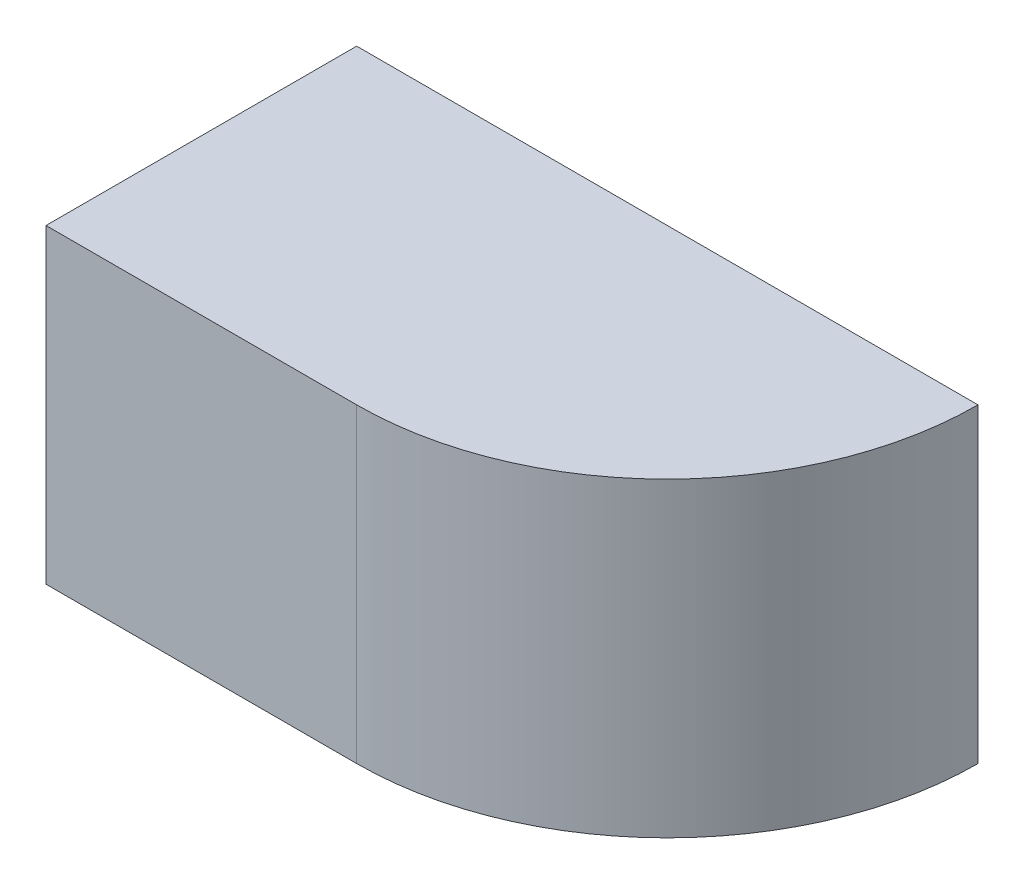
ISO-10303-21;
HEADER;
FILE_DESCRIPTION(('STEP AP214'),'2;1');
FILE_NAME('part.step','',(''),(''),'','','');
FILE_SCHEMA(('AUTOMOTIVE_DESIGN { 1 0 10303 214 1 1 1 1 }'));
ENDSEC;
DATA;
#1=APPLICATION_CONTEXT('core data for automotive mechanical design processes');
#2=APPLICATION_PROTOCOL_DEFINITION('international standard','automotive_design',2000,#1);
#3=PRODUCT_CONTEXT('',#1,'mechanical');
#4=PRODUCT('Part','Part','',(#3));
#5=PRODUCT_RELATED_PRODUCT_CATEGORY('part','',(#4));
#6=PRODUCT_DEFINITION_FORMATION('','',#4);
#7=PRODUCT_DEFINITION_CONTEXT('part definition',#1,'design');
#8=PRODUCT_DEFINITION('design','',#6,#7);
#9=PRODUCT_DEFINITION_SHAPE('','',#8);
#10=(LENGTH_UNIT() NAMED_UNIT(*) SI_UNIT(.MILLI.,.METRE.));
#11=(NAMED_UNIT(*) PLANE_ANGLE_UNIT() SI_UNIT($,.RADIAN.));
#12=(NAMED_UNIT(*) SI_UNIT($,.STERADIAN.) SOLID_ANGLE_UNIT());
#13=UNCERTAINTY_MEASURE_WITH_UNIT(LENGTH_MEASURE(1.E-05),#10,'distance_accuracy_value','');
#14=(GEOMETRIC_REPRESENTATION_CONTEXT(3) GLOBAL_UNCERTAINTY_ASSIGNED_CONTEXT((#13)) GLOBAL_UNIT_ASSIGNED_CONTEXT((#10,
#11,#12)) REPRESENTATION_CONTEXT('',''));
#15=CARTESIAN_POINT('',(0.,0.,0.));
#16=DIRECTION('',(0.,0.,1.));
#17=DIRECTION('',(1.,0.,0.));
#18=AXIS2_PLACEMENT_3D('',#15,#16,#17);
#19=CARTESIAN_POINT('',(2.00000002980232,-4.75000013038516,2.));
#20=DIRECTION('',(0.,0.,1.));
#21=DIRECTION('',(1.,0.,0.));
#22=AXIS2_PLACEMENT_3D('',#19,#20,#21);
#23=PLANE('',#22);
#24=DIRECTION('',(0.,-1.,0.));
#25=VECTOR('',#24,1.);
#26=CARTESIAN_POINT('',(1.50000002235174,-4.50000012665987,2.));
#27=LINE('',#26,#25);
#28=CARTESIAN_POINT('',(1.50000002235174,-4.50000012665987,2.));
#29=VERTEX_POINT('',#28);
#30=CARTESIAN_POINT('',(1.50000002235174,-5.00000013411045,2.));
#31=VERTEX_POINT('',#30);
#32=EDGE_CURVE('E11',#29,#31,#27,.T.);
#33=ORIENTED_EDGE('',*,*,#32,.F.);
#34=DIRECTION('',(-1.,0.,0.));
#35=VECTOR('',#34,1.);
#36=CARTESIAN_POINT('',(2.5000000372529,-4.50000012665987,2.));
#37=LINE('',#36,#35);
#38=CARTESIAN_POINT('',(2.5000000372529,-4.50000012665987,2.));
#39=VERTEX_POINT('',#38);
#40=EDGE_CURVE('E66',#39,#29,#37,.T.);
#41=ORIENTED_EDGE('',*,*,#40,.F.);
#42=DIRECTION('',(0.,1.,0.));
#43=VECTOR('',#42,1.);
#44=CARTESIAN_POINT('',(2.5000000372529,-5.00000013411045,2.));
#45=LINE('',#44,#43);
#46=CARTESIAN_POINT('',(2.5000000372529,-5.00000013411045,2.));
#47=VERTEX_POINT('',#46);
#48=EDGE_CURVE('E84',#47,#39,#45,.T.);
#49=ORIENTED_EDGE('',*,*,#48,.F.);
#50=DIRECTION('',(1.,0.,0.));
#51=VECTOR('',#50,1.);
#52=CARTESIAN_POINT('',(1.50000002235174,-5.00000013411045,2.));
#53=LINE('',#52,#51);
#54=EDGE_CURVE('E28',#31,#47,#53,.T.);
#55=ORIENTED_EDGE('',*,*,#54,.F.);
#56=EDGE_LOOP('',(#33,#41,#49,#55));
#57=FACE_BOUND('',#56,.T.);
#58=ADVANCED_FACE('F17',(#57),#23,.F.);
#59=CARTESIAN_POINT('',(1.50000002235174,-4.50000012665987,2.));
#60=DIRECTION('',(-1.,0.,0.));
#61=DIRECTION('',(0.,0.,1.));
#62=AXIS2_PLACEMENT_3D('',#59,#60,#61);
#63=PLANE('',#62);
#64=ORIENTED_EDGE('',*,*,#32,.T.);
#65=DIRECTION('',(0.,0.,1.));
#66=VECTOR('',#65,1.);
#67=CARTESIAN_POINT('',(1.50000002235174,-5.00000013411045,2.));
#68=LINE('',#67,#66);
#69=CARTESIAN_POINT('',(1.50000002235174,-5.00000013411045,2.5));
#70=VERTEX_POINT('',#69);
#71=EDGE_CURVE('E110',#31,#70,#68,.T.);
#72=ORIENTED_EDGE('',*,*,#71,.T.);
#73=DIRECTION('',(0.,-1.,0.));
#74=VECTOR('',#73,1.);
#75=CARTESIAN_POINT('',(1.50000002235174,-4.50000012665987,2.5));
#76=LINE('',#75,#74);
#77=CARTESIAN_POINT('',(1.50000002235174,-4.50000012665987,2.5));
#78=VERTEX_POINT('',#77);
#79=EDGE_CURVE('E21',#78,#70,#76,.T.);
#80=ORIENTED_EDGE('',*,*,#79,.F.);
#81=DIRECTION('',(0.,0.,1.));
#82=VECTOR('',#81,1.);
#83=CARTESIAN_POINT('',(1.50000002235174,-4.50000012665987,2.));
#84=LINE('',#83,#82);
#85=EDGE_CURVE('E79',#29,#78,#84,.T.);
#86=ORIENTED_EDGE('',*,*,#85,.F.);
#87=EDGE_LOOP('',(#64,#72,#80,#86));
#88=FACE_BOUND('',#87,.T.);
#89=ADVANCED_FACE('F108',(#88),#63,.T.);
#90=CARTESIAN_POINT('',(1.50000002235174,-5.00000013411045,2.));
#91=DIRECTION('',(0.,-1.,0.));
#92=DIRECTION('',(0.,0.,-1.));
#93=AXIS2_PLACEMENT_3D('',#90,#91,#92);
#94=PLANE('',#93);
#95=CARTESIAN_POINT('',(2.0000000372529,-5.00000013411045,2.));
#96=DIRECTION('',(0.,1.,0.));
#97=DIRECTION('',(0.707106781186548,0.,0.707106781186548));
#98=AXIS2_PLACEMENT_3D('',#95,#96,#97);
#99=CIRCLE('',#98,0.5);
#100=CARTESIAN_POINT('',(2.0000000372529,-5.00000013411045,2.5));
#101=VERTEX_POINT('',#100);
#102=EDGE_CURVE('E95',#101,#47,#99,.T.);
#103=ORIENTED_EDGE('',*,*,#102,.F.);
#104=DIRECTION('',(1.,0.,0.));
#105=VECTOR('',#104,1.);
#106=CARTESIAN_POINT('',(1.50000002235174,-5.00000013411045,2.5));
#107=LINE('',#106,#105);
#108=EDGE_CURVE('E90',#70,#101,#107,.T.);
#109=ORIENTED_EDGE('',*,*,#108,.F.);
#110=ORIENTED_EDGE('',*,*,#71,.F.);
#111=ORIENTED_EDGE('',*,*,#54,.T.);
#112=EDGE_LOOP('',(#103,#109,#110,#111));
#113=FACE_BOUND('',#112,.T.);
#114=ADVANCED_FACE('F114',(#113),#94,.T.);
#115=CARTESIAN_POINT('',(2.5000000372529,-4.50000012665987,2.));
#116=DIRECTION('',(0.,1.,0.));
#117=DIRECTION('',(1.,0.,0.));
#118=AXIS2_PLACEMENT_3D('',#115,#116,#117);
#119=PLANE('',#118);
#120=CARTESIAN_POINT('',(2.0000000372529,-4.50000012665987,2.));
#121=DIRECTION('',(0.,-1.,0.));
#122=DIRECTION('',(0.707106781186548,0.,0.707106781186548));
#123=AXIS2_PLACEMENT_3D('',#120,#121,#122);
#124=CIRCLE('',#123,0.5);
#125=CARTESIAN_POINT('',(2.0000000372529,-4.50000012665987,2.5));
#126=VERTEX_POINT('',#125);
#127=EDGE_CURVE('E78',#39,#126,#124,.T.);
#128=ORIENTED_EDGE('',*,*,#127,.F.);
#129=ORIENTED_EDGE('',*,*,#40,.T.);
#130=ORIENTED_EDGE('',*,*,#85,.T.);
#131=DIRECTION('',(-1.,0.,0.));
#132=VECTOR('',#131,1.);
#133=CARTESIAN_POINT('',(2.5000000372529,-4.50000012665987,2.5));
#134=LINE('',#133,#132);
#135=EDGE_CURVE('E74',#126,#78,#134,.T.);
#136=ORIENTED_EDGE('',*,*,#135,.F.);
#137=EDGE_LOOP('',(#128,#129,#130,#136));
#138=FACE_BOUND('',#137,.T.);
#139=ADVANCED_FACE('F76',(#138),#119,.T.);
#140=CARTESIAN_POINT('',(2.00000002980232,-4.75000013038516,2.5));
#141=DIRECTION('',(0.,0.,1.));
#142=DIRECTION('',(1.,0.,0.));
#143=AXIS2_PLACEMENT_3D('',#140,#141,#142);
#144=PLANE('',#143);
#145=DIRECTION('',(0.,-1.,0.));
#146=VECTOR('',#145,1.);
#147=CARTESIAN_POINT('',(2.0000000372529,-4.87500013224781,2.5));
#148=LINE('',#147,#146);
#149=EDGE_CURVE('E87',#126,#101,#148,.T.);
#150=ORIENTED_EDGE('',*,*,#149,.F.);
#151=ORIENTED_EDGE('',*,*,#135,.T.);
#152=ORIENTED_EDGE('',*,*,#79,.T.);
#153=ORIENTED_EDGE('',*,*,#108,.T.);
#154=EDGE_LOOP('',(#150,#151,#152,#153));
#155=FACE_BOUND('',#154,.T.);
#156=ADVANCED_FACE('F88',(#155),#144,.T.);
#157=CARTESIAN_POINT('',(2.0000000372529,-4.87500013224781,2.));
#158=DIRECTION('',(0.,1.,0.));
#159=DIRECTION('',(0.707106781186548,0.,0.707106781186548));
#160=AXIS2_PLACEMENT_3D('',#157,#158,#159);
#161=CYLINDRICAL_SURFACE('',#160,0.5);
#162=ORIENTED_EDGE('',*,*,#127,.T.);
#163=ORIENTED_EDGE('',*,*,#149,.T.);
#164=ORIENTED_EDGE('',*,*,#102,.T.);
#165=ORIENTED_EDGE('',*,*,#48,.T.);
#166=EDGE_LOOP('',(#162,#163,#164,#165));
#167=FACE_BOUND('',#166,.T.);
#168=ADVANCED_FACE('F19',(#167),#161,.T.);
#169=CLOSED_SHELL('',(#58,#89,#114,#139,#156,#168));
#170=MANIFOLD_SOLID_BREP('B1',#169);
#171=ADVANCED_BREP_SHAPE_REPRESENTATION('',(#18,#170),#14);
#172=SHAPE_DEFINITION_REPRESENTATION(#9,#171);
ENDSEC;
END-ISO-10303-21;
